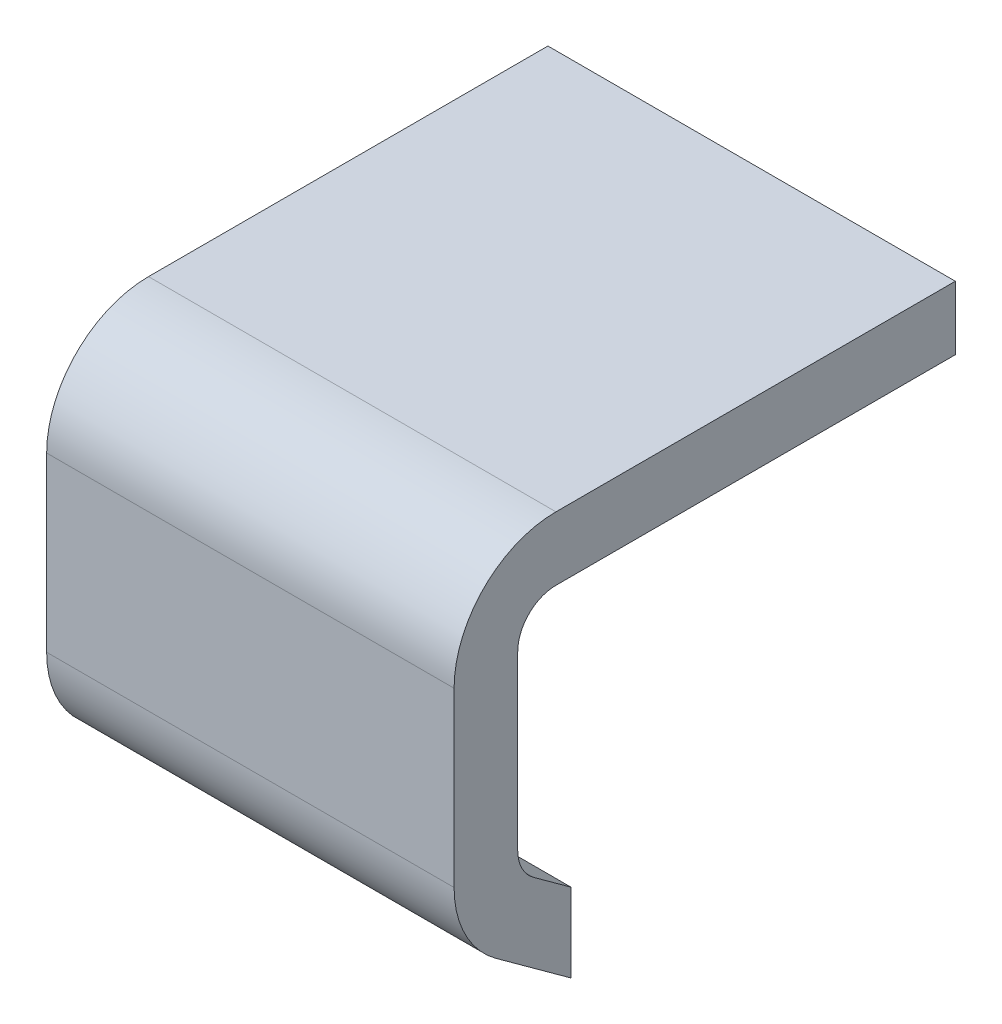
ISO-10303-21;
HEADER;
FILE_DESCRIPTION(('STEP AP214'),'2;1');
FILE_NAME('part.step','',(''),(''),'','','');
FILE_SCHEMA(('AUTOMOTIVE_DESIGN { 1 0 10303 214 1 1 1 1 }'));
ENDSEC;
DATA;
#1=APPLICATION_CONTEXT('core data for automotive mechanical design processes');
#2=APPLICATION_PROTOCOL_DEFINITION('international standard','automotive_design',2000,#1);
#3=PRODUCT_CONTEXT('',#1,'mechanical');
#4=PRODUCT('Part','Part','',(#3));
#5=PRODUCT_RELATED_PRODUCT_CATEGORY('part','',(#4));
#6=PRODUCT_DEFINITION_FORMATION('','',#4);
#7=PRODUCT_DEFINITION_CONTEXT('part definition',#1,'design');
#8=PRODUCT_DEFINITION('design','',#6,#7);
#9=PRODUCT_DEFINITION_SHAPE('','',#8);
#10=(LENGTH_UNIT() NAMED_UNIT(*) SI_UNIT(.MILLI.,.METRE.));
#11=(NAMED_UNIT(*) PLANE_ANGLE_UNIT() SI_UNIT($,.RADIAN.));
#12=(NAMED_UNIT(*) SI_UNIT($,.STERADIAN.) SOLID_ANGLE_UNIT());
#13=UNCERTAINTY_MEASURE_WITH_UNIT(LENGTH_MEASURE(1.E-05),#10,'distance_accuracy_value','');
#14=(GEOMETRIC_REPRESENTATION_CONTEXT(3) GLOBAL_UNCERTAINTY_ASSIGNED_CONTEXT((#13)) GLOBAL_UNIT_ASSIGNED_CONTEXT((#10,
#11,#12)) REPRESENTATION_CONTEXT('',''));
#15=CARTESIAN_POINT('',(0.,0.,0.));
#16=DIRECTION('',(0.,0.,1.));
#17=DIRECTION('',(1.,0.,0.));
#18=AXIS2_PLACEMENT_3D('',#15,#16,#17);
#19=CARTESIAN_POINT('',(-1.14445721431417,2.794,0.00459852546605234));
#20=DIRECTION('',(1.,0.,0.));
#21=DIRECTION('',(0.,0.,-1.));
#22=AXIS2_PLACEMENT_3D('',#19,#20,#21);
#23=CYLINDRICAL_SURFACE('',#22,0.2032);
#24=CARTESIAN_POINT('',(-1.1684,2.794,0.00459852546605234));
#25=DIRECTION('',(1.,0.,0.));
#26=DIRECTION('',(0.,0.,-1.));
#27=AXIS2_PLACEMENT_3D('',#24,#25,#26);
#28=CIRCLE('',#27,0.2032);
#29=CARTESIAN_POINT('',(-1.1684,2.9972,0.00459852546605233));
#30=VERTEX_POINT('',#29);
#31=CARTESIAN_POINT('',(-1.1684,2.794,0.20779852546605));
#32=VERTEX_POINT('',#31);
#33=EDGE_CURVE('E124',#30,#32,#28,.T.);
#34=ORIENTED_EDGE('',*,*,#33,.F.);
#35=DIRECTION('',(1.,0.,0.));
#36=VECTOR('',#35,1.);
#37=CARTESIAN_POINT('',(-1.5748,2.9972,0.00459852546605232));
#38=LINE('',#37,#36);
#39=CARTESIAN_POINT('',(-1.9812,2.9972,0.00459852546605233));
#40=VERTEX_POINT('',#39);
#41=EDGE_CURVE('E107',#40,#30,#38,.T.);
#42=ORIENTED_EDGE('',*,*,#41,.F.);
#43=CARTESIAN_POINT('',(-1.9812,2.794,0.00459852546605234));
#44=DIRECTION('',(1.,0.,0.));
#45=DIRECTION('',(0.,0.,-1.));
#46=AXIS2_PLACEMENT_3D('',#43,#44,#45);
#47=CIRCLE('',#46,0.2032);
#48=CARTESIAN_POINT('',(-1.9812,2.794,0.20779852546605));
#49=VERTEX_POINT('',#48);
#50=EDGE_CURVE('E19',#40,#49,#47,.T.);
#51=ORIENTED_EDGE('',*,*,#50,.T.);
#52=DIRECTION('',(1.,0.,0.));
#53=VECTOR('',#52,1.);
#54=CARTESIAN_POINT('',(-1.5748,2.794,0.20779852546605));
#55=LINE('',#54,#53);
#56=EDGE_CURVE('E91',#32,#49,#55,.F.);
#57=ORIENTED_EDGE('',*,*,#56,.F.);
#58=EDGE_LOOP('',(#34,#42,#51,#57));
#59=FACE_BOUND('',#58,.T.);
#60=ADVANCED_FACE('F16',(#59),#23,.T.);
#61=CARTESIAN_POINT('',(-1.5748,2.62187788786696,0.20779852546605));
#62=DIRECTION('',(0.,0.,1.));
#63=DIRECTION('',(1.,0.,0.));
#64=AXIS2_PLACEMENT_3D('',#61,#62,#63);
#65=PLANE('',#64);
#66=DIRECTION('',(0.,1.,0.));
#67=VECTOR('',#66,1.);
#68=CARTESIAN_POINT('',(-1.1684,2.8956,0.20779852546605));
#69=LINE('',#68,#67);
#70=CARTESIAN_POINT('',(-1.1684,2.44975577573621,0.207798525466051));
#71=VERTEX_POINT('',#70);
#72=EDGE_CURVE('E95',#32,#71,#69,.F.);
#73=ORIENTED_EDGE('',*,*,#72,.F.);
#74=ORIENTED_EDGE('',*,*,#56,.T.);
#75=DIRECTION('',(0.,1.,0.));
#76=VECTOR('',#75,1.);
#77=CARTESIAN_POINT('',(-1.9812,2.9337,0.20779852546605));
#78=LINE('',#77,#76);
#79=CARTESIAN_POINT('',(-1.9812,2.44975577573621,0.207798525466051));
#80=VERTEX_POINT('',#79);
#81=EDGE_CURVE('E94',#49,#80,#78,.F.);
#82=ORIENTED_EDGE('',*,*,#81,.T.);
#83=DIRECTION('',(1.,0.,0.));
#84=VECTOR('',#83,1.);
#85=CARTESIAN_POINT('',(-1.14445721431417,2.44975577573621,0.207798525466052));
#86=LINE('',#85,#84);
#87=EDGE_CURVE('E98',#71,#80,#86,.F.);
#88=ORIENTED_EDGE('',*,*,#87,.F.);
#89=EDGE_LOOP('',(#73,#74,#82,#88));
#90=FACE_BOUND('',#89,.T.);
#91=ADVANCED_FACE('F92',(#90),#65,.T.);
#92=CARTESIAN_POINT('',(-1.14445721431417,2.44975577573621,0.00459852546605234));
#93=DIRECTION('',(1.,0.,0.));
#94=DIRECTION('',(0.,0.,-1.));
#95=AXIS2_PLACEMENT_3D('',#92,#93,#94);
#96=CYLINDRICAL_SURFACE('',#95,0.2032);
#97=CARTESIAN_POINT('',(-1.1684,2.44975577573621,0.00459852546605234));
#98=DIRECTION('',(1.,0.,0.));
#99=DIRECTION('',(0.,0.,-1.));
#100=AXIS2_PLACEMENT_3D('',#97,#98,#99);
#101=CIRCLE('',#100,0.2032);
#102=CARTESIAN_POINT('',(-1.1684,2.28536352247927,0.124036488731884));
#103=VERTEX_POINT('',#102);
#104=EDGE_CURVE('E164',#71,#103,#101,.T.);
#105=ORIENTED_EDGE('',*,*,#104,.F.);
#106=ORIENTED_EDGE('',*,*,#87,.T.);
#107=CARTESIAN_POINT('',(-1.9812,2.44975577573621,0.00459852546605234));
#108=DIRECTION('',(1.,0.,0.));
#109=DIRECTION('',(0.,0.,-1.));
#110=AXIS2_PLACEMENT_3D('',#107,#108,#109);
#111=CIRCLE('',#110,0.2032);
#112=CARTESIAN_POINT('',(-1.9812,2.28536352247928,0.12403648873189));
#113=VERTEX_POINT('',#112);
#114=EDGE_CURVE('E105',#80,#113,#111,.T.);
#115=ORIENTED_EDGE('',*,*,#114,.T.);
#116=DIRECTION('',(1.,0.,0.));
#117=VECTOR('',#116,1.);
#118=CARTESIAN_POINT('',(-1.5748,2.28536352247927,0.124036488731813));
#119=LINE('',#118,#117);
#120=EDGE_CURVE('E146',#113,#103,#119,.T.);
#121=ORIENTED_EDGE('',*,*,#120,.T.);
#122=EDGE_LOOP('',(#105,#106,#115,#121));
#123=FACE_BOUND('',#122,.T.);
#124=ADVANCED_FACE('F269',(#123),#96,.T.);
#125=CARTESIAN_POINT('',(-1.5748,2.23107754032952,0.0493182443658794));
#126=DIRECTION('',(0.,0.809016994374918,-0.587785252292513));
#127=DIRECTION('',(0.,0.587785252292513,0.809016994374918));
#128=AXIS2_PLACEMENT_3D('',#125,#126,#127);
#129=PLANE('',#128);
#130=ORIENTED_EDGE('',*,*,#120,.F.);
#131=DIRECTION('',(0.,-0.587785252292903,-0.809016994374635));
#132=VECTOR('',#131,1.);
#133=CARTESIAN_POINT('',(-1.9812,2.28536352247921,0.12403648873186));
#134=LINE('',#133,#132);
#135=CARTESIAN_POINT('',(-1.9812,2.17679155817958,-0.0254000000000169));
#136=VERTEX_POINT('',#135);
#137=EDGE_CURVE('E156',#113,#136,#134,.T.);
#138=ORIENTED_EDGE('',*,*,#137,.T.);
#139=DIRECTION('',(1.,0.,0.));
#140=VECTOR('',#139,1.);
#141=CARTESIAN_POINT('',(-1.5748,2.17679155817958,-0.0254));
#142=LINE('',#141,#140);
#143=CARTESIAN_POINT('',(-1.1684,2.17679155817958,-0.0254000000000339));
#144=VERTEX_POINT('',#143);
#145=EDGE_CURVE('E134',#136,#144,#142,.T.);
#146=ORIENTED_EDGE('',*,*,#145,.T.);
#147=DIRECTION('',(0.,-0.587785252292837,-0.809016994374683));
#148=VECTOR('',#147,1.);
#149=CARTESIAN_POINT('',(-1.1684,2.28536352247921,0.12403648873186));
#150=LINE('',#149,#148);
#151=EDGE_CURVE('E141',#103,#144,#150,.T.);
#152=ORIENTED_EDGE('',*,*,#151,.F.);
#153=EDGE_LOOP('',(#130,#138,#146,#152));
#154=FACE_BOUND('',#153,.T.);
#155=ADVANCED_FACE('F210',(#154),#129,.F.);
#156=CARTESIAN_POINT('',(-1.5748,2.25528187475083,-0.0254));
#157=DIRECTION('',(0.,0.,1.));
#158=DIRECTION('',(1.,0.,0.));
#159=AXIS2_PLACEMENT_3D('',#156,#157,#158);
#160=PLANE('',#159);
#161=DIRECTION('',(1.,0.,0.));
#162=VECTOR('',#161,1.);
#163=CARTESIAN_POINT('',(-1.5748,2.33377219132205,-0.0253999999999711));
#164=LINE('',#163,#162);
#165=CARTESIAN_POINT('',(-1.1684,2.33377219132204,-0.0254000000000242));
#166=VERTEX_POINT('',#165);
#167=CARTESIAN_POINT('',(-1.9812,2.33377219132205,-0.0254000000000073));
#168=VERTEX_POINT('',#167);
#169=EDGE_CURVE('E131',#166,#168,#164,.F.);
#170=ORIENTED_EDGE('',*,*,#169,.F.);
#171=DIRECTION('',(0.,1.,0.));
#172=VECTOR('',#171,1.);
#173=CARTESIAN_POINT('',(-1.1684,2.8956,-0.0254000000000508));
#174=LINE('',#173,#172);
#175=EDGE_CURVE('E137',#144,#166,#174,.T.);
#176=ORIENTED_EDGE('',*,*,#175,.F.);
#177=ORIENTED_EDGE('',*,*,#145,.F.);
#178=DIRECTION('',(0.,1.,0.));
#179=VECTOR('',#178,1.);
#180=CARTESIAN_POINT('',(-1.9812,2.9337,-0.0254000000000254));
#181=LINE('',#180,#179);
#182=EDGE_CURVE('E152',#136,#168,#181,.T.);
#183=ORIENTED_EDGE('',*,*,#182,.T.);
#184=EDGE_LOOP('',(#170,#176,#177,#183));
#185=FACE_BOUND('',#184,.T.);
#186=ADVANCED_FACE('F207',(#185),#160,.F.);
#187=CARTESIAN_POINT('',(-1.5748,2.36094043604339,0.0119938808453628));
#188=DIRECTION('',(0.,0.809016994374577,-0.587785252292983));
#189=DIRECTION('',(0.,0.587785252292983,0.809016994374577));
#190=AXIS2_PLACEMENT_3D('',#187,#188,#189);
#191=PLANE('',#190);
#192=DIRECTION('',(0.,0.587785252292436,0.809016994374974));
#193=VECTOR('',#192,1.);
#194=CARTESIAN_POINT('',(-1.1684,2.33377219132208,-0.0253999999999873));
#195=LINE('',#194,#193);
#196=CARTESIAN_POINT('',(-1.1684,2.38810868076473,0.0493877616907603));
#197=VERTEX_POINT('',#196);
#198=EDGE_CURVE('E140',#166,#197,#195,.T.);
#199=ORIENTED_EDGE('',*,*,#198,.F.);
#200=ORIENTED_EDGE('',*,*,#169,.T.);
#201=DIRECTION('',(0.,0.587785252292436,0.809016994374974));
#202=VECTOR('',#201,1.);
#203=CARTESIAN_POINT('',(-1.9812,2.33377219132208,-0.0253999999999873));
#204=LINE('',#203,#202);
#205=CARTESIAN_POINT('',(-1.9812,2.38810868076473,0.0493877616907603));
#206=VERTEX_POINT('',#205);
#207=EDGE_CURVE('E155',#168,#206,#204,.T.);
#208=ORIENTED_EDGE('',*,*,#207,.T.);
#209=DIRECTION('',(1.,0.,0.));
#210=VECTOR('',#209,1.);
#211=CARTESIAN_POINT('',(-1.14445721431417,2.3881086807647,0.0493877616907273));
#212=LINE('',#211,#210);
#213=EDGE_CURVE('E128',#206,#197,#212,.T.);
#214=ORIENTED_EDGE('',*,*,#213,.T.);
#215=EDGE_LOOP('',(#199,#200,#208,#214));
#216=FACE_BOUND('',#215,.T.);
#217=ADVANCED_FACE('F199',(#216),#191,.T.);
#218=CARTESIAN_POINT('',(-1.14445721431417,2.44975577573621,0.00459852546605234));
#219=DIRECTION('',(1.,0.,0.));
#220=DIRECTION('',(0.,0.,-1.));
#221=AXIS2_PLACEMENT_3D('',#218,#219,#220);
#222=CYLINDRICAL_SURFACE('',#221,0.0762000000001016);
#223=ORIENTED_EDGE('',*,*,#213,.F.);
#224=CARTESIAN_POINT('',(-1.9812,2.44975577573621,0.00459852546605234));
#225=DIRECTION('',(1.,0.,0.));
#226=DIRECTION('',(0.,0.,-1.));
#227=AXIS2_PLACEMENT_3D('',#224,#225,#226);
#228=CIRCLE('',#227,0.0762000000001016);
#229=CARTESIAN_POINT('',(-1.9812,2.44975577573621,0.0807985254661006));
#230=VERTEX_POINT('',#229);
#231=EDGE_CURVE('E170',#206,#230,#228,.F.);
#232=ORIENTED_EDGE('',*,*,#231,.T.);
#233=DIRECTION('',(1.,0.,0.));
#234=VECTOR('',#233,1.);
#235=CARTESIAN_POINT('',(-1.5748,2.44975577573621,0.0807985254660498));
#236=LINE('',#235,#234);
#237=CARTESIAN_POINT('',(-1.1684,2.44975577573621,0.0807985254660498));
#238=VERTEX_POINT('',#237);
#239=EDGE_CURVE('E115',#230,#238,#236,.T.);
#240=ORIENTED_EDGE('',*,*,#239,.T.);
#241=CARTESIAN_POINT('',(-1.1684,2.44975577573621,0.00459852546605234));
#242=DIRECTION('',(1.,0.,0.));
#243=DIRECTION('',(0.,0.,-1.));
#244=AXIS2_PLACEMENT_3D('',#241,#242,#243);
#245=CIRCLE('',#244,0.0762000000001016);
#246=EDGE_CURVE('E162',#197,#238,#245,.F.);
#247=ORIENTED_EDGE('',*,*,#246,.F.);
#248=EDGE_LOOP('',(#223,#232,#240,#247));
#249=FACE_BOUND('',#248,.T.);
#250=ADVANCED_FACE('F259',(#249),#222,.F.);
#251=CARTESIAN_POINT('',(-1.5748,2.62187788786696,0.0807985254660498));
#252=DIRECTION('',(0.,0.,1.));
#253=DIRECTION('',(1.,0.,0.));
#254=AXIS2_PLACEMENT_3D('',#251,#252,#253);
#255=PLANE('',#254);
#256=ORIENTED_EDGE('',*,*,#239,.F.);
#257=DIRECTION('',(0.,1.,0.));
#258=VECTOR('',#257,1.);
#259=CARTESIAN_POINT('',(-1.9812,2.9337,0.0807985254661514));
#260=LINE('',#259,#258);
#261=CARTESIAN_POINT('',(-1.9812,2.794,0.0807985254661019));
#262=VERTEX_POINT('',#261);
#263=EDGE_CURVE('E172',#230,#262,#260,.T.);
#264=ORIENTED_EDGE('',*,*,#263,.T.);
#265=DIRECTION('',(1.,0.,0.));
#266=VECTOR('',#265,1.);
#267=CARTESIAN_POINT('',(-1.14445721431417,2.794,0.0807985254660523));
#268=LINE('',#267,#266);
#269=CARTESIAN_POINT('',(-1.1684,2.794,0.0807985254660511));
#270=VERTEX_POINT('',#269);
#271=EDGE_CURVE('E121',#262,#270,#268,.T.);
#272=ORIENTED_EDGE('',*,*,#271,.T.);
#273=DIRECTION('',(0.,1.,0.));
#274=VECTOR('',#273,1.);
#275=CARTESIAN_POINT('',(-1.1684,2.8956,0.0807985254660498));
#276=LINE('',#275,#274);
#277=EDGE_CURVE('E161',#238,#270,#276,.T.);
#278=ORIENTED_EDGE('',*,*,#277,.F.);
#279=EDGE_LOOP('',(#256,#264,#272,#278));
#280=FACE_BOUND('',#279,.T.);
#281=ADVANCED_FACE('F256',(#280),#255,.F.);
#282=CARTESIAN_POINT('',(-1.5748,2.9972,-0.393800120335954));
#283=DIRECTION('',(0.,1.,0.));
#284=DIRECTION('',(0.,0.,1.));
#285=AXIS2_PLACEMENT_3D('',#282,#283,#284);
#286=PLANE('',#285);
#287=DIRECTION('',(1.,0.,0.));
#288=VECTOR('',#287,1.);
#289=CARTESIAN_POINT('',(-1.5748,2.9972,-0.79219876613778));
#290=LINE('',#289,#288);
#291=CARTESIAN_POINT('',(-1.1684,2.9972,-0.79219876613778));
#292=VERTEX_POINT('',#291);
#293=CARTESIAN_POINT('',(-1.9812,2.9972,-0.79219876613778));
#294=VERTEX_POINT('',#293);
#295=EDGE_CURVE('E109',#292,#294,#290,.F.);
#296=ORIENTED_EDGE('',*,*,#295,.T.);
#297=DIRECTION('',(0.,0.,-1.));
#298=VECTOR('',#297,1.);
#299=CARTESIAN_POINT('',(-1.9812,2.9972,-0.393800120335954));
#300=LINE('',#299,#298);
#301=EDGE_CURVE('E169',#294,#40,#300,.F.);
#302=ORIENTED_EDGE('',*,*,#301,.T.);
#303=ORIENTED_EDGE('',*,*,#41,.T.);
#304=DIRECTION('',(0.,0.,-1.));
#305=VECTOR('',#304,1.);
#306=CARTESIAN_POINT('',(-1.1684,2.9972,0.10619852546605));
#307=LINE('',#306,#305);
#308=EDGE_CURVE('E230',#292,#30,#307,.F.);
#309=ORIENTED_EDGE('',*,*,#308,.F.);
#310=EDGE_LOOP('',(#296,#302,#303,#309));
#311=FACE_BOUND('',#310,.T.);
#312=ADVANCED_FACE('F253',(#311),#286,.T.);
#313=CARTESIAN_POINT('',(-1.5748,2.9337,-0.79219876613778));
#314=DIRECTION('',(0.,0.,1.));
#315=DIRECTION('',(1.,0.,0.));
#316=AXIS2_PLACEMENT_3D('',#313,#314,#315);
#317=PLANE('',#316);
#318=ORIENTED_EDGE('',*,*,#295,.F.);
#319=DIRECTION('',(0.,1.,0.));
#320=VECTOR('',#319,1.);
#321=CARTESIAN_POINT('',(-1.1684,2.8956,-0.79219876613778));
#322=LINE('',#321,#320);
#323=CARTESIAN_POINT('',(-1.1684,2.8702,-0.79219876613778));
#324=VERTEX_POINT('',#323);
#325=EDGE_CURVE('E160',#324,#292,#322,.T.);
#326=ORIENTED_EDGE('',*,*,#325,.F.);
#327=DIRECTION('',(1.,0.,0.));
#328=VECTOR('',#327,1.);
#329=CARTESIAN_POINT('',(-1.5748,2.8702,-0.79219876613778));
#330=LINE('',#329,#328);
#331=CARTESIAN_POINT('',(-1.9812,2.8702,-0.79219876613778));
#332=VERTEX_POINT('',#331);
#333=EDGE_CURVE('E223',#324,#332,#330,.F.);
#334=ORIENTED_EDGE('',*,*,#333,.T.);
#335=DIRECTION('',(0.,1.,0.));
#336=VECTOR('',#335,1.);
#337=CARTESIAN_POINT('',(-1.9812,2.9337,-0.79219876613778));
#338=LINE('',#337,#336);
#339=EDGE_CURVE('E183',#332,#294,#338,.T.);
#340=ORIENTED_EDGE('',*,*,#339,.T.);
#341=EDGE_LOOP('',(#318,#326,#334,#340));
#342=FACE_BOUND('',#341,.T.);
#343=ADVANCED_FACE('F233',(#342),#317,.F.);
#344=CARTESIAN_POINT('',(-1.9812,2.9337,-0.393800120335954));
#345=DIRECTION('',(1.,0.,0.));
#346=DIRECTION('',(0.,0.,-1.));
#347=AXIS2_PLACEMENT_3D('',#344,#345,#346);
#348=PLANE('',#347);
#349=ORIENTED_EDGE('',*,*,#339,.F.);
#350=DIRECTION('',(0.,0.,1.));
#351=VECTOR('',#350,1.);
#352=CARTESIAN_POINT('',(-1.9812,2.8702,-0.393800120335954));
#353=LINE('',#352,#351);
#354=CARTESIAN_POINT('',(-1.9812,2.8702,0.00459852546605233));
#355=VERTEX_POINT('',#354);
#356=EDGE_CURVE('E229',#332,#355,#353,.T.);
#357=ORIENTED_EDGE('',*,*,#356,.T.);
#358=CARTESIAN_POINT('',(-1.9812,2.794,0.00459852546605234));
#359=DIRECTION('',(1.,0.,0.));
#360=DIRECTION('',(0.,0.,-1.));
#361=AXIS2_PLACEMENT_3D('',#358,#359,#360);
#362=CIRCLE('',#361,0.0762);
#363=EDGE_CURVE('E125',#355,#262,#362,.T.);
#364=ORIENTED_EDGE('',*,*,#363,.T.);
#365=ORIENTED_EDGE('',*,*,#263,.F.);
#366=ORIENTED_EDGE('',*,*,#231,.F.);
#367=ORIENTED_EDGE('',*,*,#207,.F.);
#368=ORIENTED_EDGE('',*,*,#182,.F.);
#369=ORIENTED_EDGE('',*,*,#137,.F.);
#370=ORIENTED_EDGE('',*,*,#114,.F.);
#371=ORIENTED_EDGE('',*,*,#81,.F.);
#372=ORIENTED_EDGE('',*,*,#50,.F.);
#373=ORIENTED_EDGE('',*,*,#301,.F.);
#374=EDGE_LOOP('',(#349,#357,#364,#365,#366,#367,#368,#369,#370,#371,#372,#373));
#375=FACE_BOUND('',#374,.T.);
#376=ADVANCED_FACE('F102',(#375),#348,.F.);
#377=CARTESIAN_POINT('',(-1.14445721431417,2.794,0.00459852546605234));
#378=DIRECTION('',(1.,0.,0.));
#379=DIRECTION('',(0.,0.,-1.));
#380=AXIS2_PLACEMENT_3D('',#377,#378,#379);
#381=CYLINDRICAL_SURFACE('',#380,0.0762);
#382=ORIENTED_EDGE('',*,*,#271,.F.);
#383=ORIENTED_EDGE('',*,*,#363,.F.);
#384=DIRECTION('',(1.,0.,0.));
#385=VECTOR('',#384,1.);
#386=CARTESIAN_POINT('',(-1.5748,2.8702,0.00459852546605232));
#387=LINE('',#386,#385);
#388=CARTESIAN_POINT('',(-1.1684,2.8702,0.00459852546605233));
#389=VERTEX_POINT('',#388);
#390=EDGE_CURVE('E25',#355,#389,#387,.T.);
#391=ORIENTED_EDGE('',*,*,#390,.T.);
#392=CARTESIAN_POINT('',(-1.1684,2.794,0.00459852546605234));
#393=DIRECTION('',(1.,0.,0.));
#394=DIRECTION('',(0.,0.,-1.));
#395=AXIS2_PLACEMENT_3D('',#392,#393,#394);
#396=CIRCLE('',#395,0.0762);
#397=EDGE_CURVE('E33',#270,#389,#396,.F.);
#398=ORIENTED_EDGE('',*,*,#397,.F.);
#399=EDGE_LOOP('',(#382,#383,#391,#398));
#400=FACE_BOUND('',#399,.T.);
#401=ADVANCED_FACE('F238',(#400),#381,.F.);
#402=CARTESIAN_POINT('',(-1.1684,2.8956,0.10619852546605));
#403=DIRECTION('',(1.,0.,0.));
#404=DIRECTION('',(0.,0.,-1.));
#405=AXIS2_PLACEMENT_3D('',#402,#403,#404);
#406=PLANE('',#405);
#407=ORIENTED_EDGE('',*,*,#325,.T.);
#408=ORIENTED_EDGE('',*,*,#308,.T.);
#409=ORIENTED_EDGE('',*,*,#33,.T.);
#410=ORIENTED_EDGE('',*,*,#72,.T.);
#411=ORIENTED_EDGE('',*,*,#104,.T.);
#412=ORIENTED_EDGE('',*,*,#151,.T.);
#413=ORIENTED_EDGE('',*,*,#175,.T.);
#414=ORIENTED_EDGE('',*,*,#198,.T.);
#415=ORIENTED_EDGE('',*,*,#246,.T.);
#416=ORIENTED_EDGE('',*,*,#277,.T.);
#417=ORIENTED_EDGE('',*,*,#397,.T.);
#418=DIRECTION('',(0.,0.,1.));
#419=VECTOR('',#418,1.);
#420=CARTESIAN_POINT('',(-1.1684,2.8702,-0.393800120335954));
#421=LINE('',#420,#419);
#422=EDGE_CURVE('E11',#389,#324,#421,.F.);
#423=ORIENTED_EDGE('',*,*,#422,.T.);
#424=EDGE_LOOP('',(#407,#408,#409,#410,#411,#412,#413,#414,#415,#416,#417,#423));
#425=FACE_BOUND('',#424,.T.);
#426=ADVANCED_FACE('F236',(#425),#406,.T.);
#427=CARTESIAN_POINT('',(-1.5748,2.8702,-0.393800120335954));
#428=DIRECTION('',(0.,1.,0.));
#429=DIRECTION('',(0.,0.,1.));
#430=AXIS2_PLACEMENT_3D('',#427,#428,#429);
#431=PLANE('',#430);
#432=ORIENTED_EDGE('',*,*,#390,.F.);
#433=ORIENTED_EDGE('',*,*,#356,.F.);
#434=ORIENTED_EDGE('',*,*,#333,.F.);
#435=ORIENTED_EDGE('',*,*,#422,.F.);
#436=EDGE_LOOP('',(#432,#433,#434,#435));
#437=FACE_BOUND('',#436,.T.);
#438=ADVANCED_FACE('F226',(#437),#431,.F.);
#439=CLOSED_SHELL('',(#60,#91,#124,#155,#186,#217,#250,#281,#312,#343,#376,#401,#426,#438));
#440=MANIFOLD_SOLID_BREP('B1',#439);
#441=ADVANCED_BREP_SHAPE_REPRESENTATION('',(#18,#440),#14);
#442=SHAPE_DEFINITION_REPRESENTATION(#9,#441);
ENDSEC;
END-ISO-10303-21;
